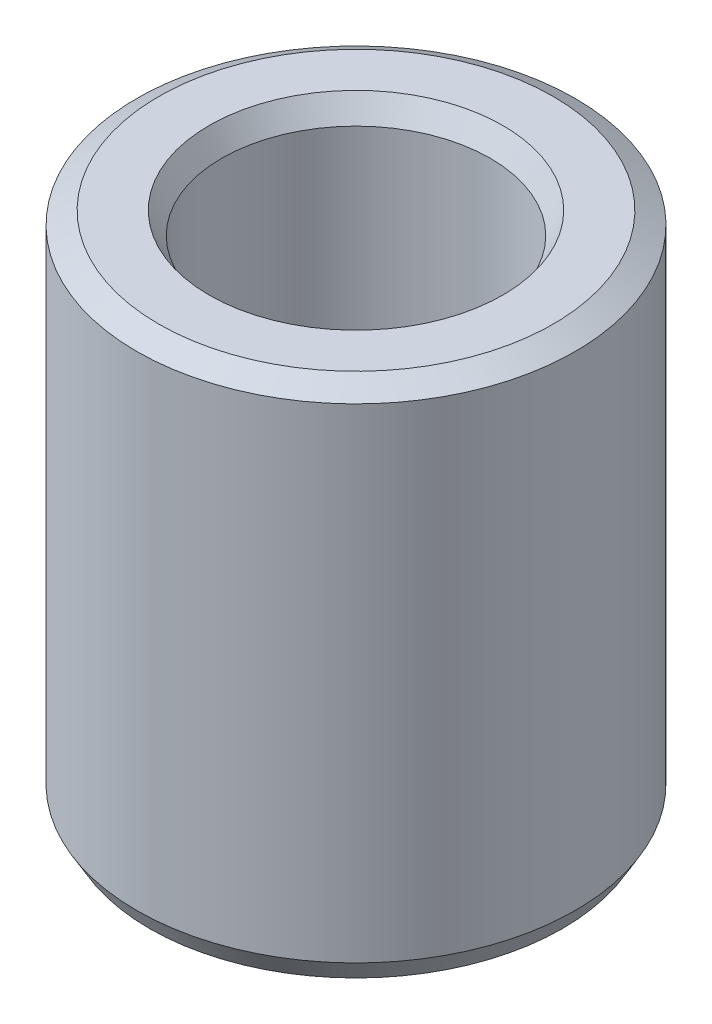
ISO-10303-21;
HEADER;
FILE_DESCRIPTION(('STEP AP214'),'2;1');
FILE_NAME('part.step','',(''),(''),'','','');
FILE_SCHEMA(('AUTOMOTIVE_DESIGN { 1 0 10303 214 1 1 1 1 }'));
ENDSEC;
DATA;
#1=APPLICATION_CONTEXT('core data for automotive mechanical design processes');
#2=APPLICATION_PROTOCOL_DEFINITION('international standard','automotive_design',2000,#1);
#3=PRODUCT_CONTEXT('',#1,'mechanical');
#4=PRODUCT('Part','Part','',(#3));
#5=PRODUCT_RELATED_PRODUCT_CATEGORY('part','',(#4));
#6=PRODUCT_DEFINITION_FORMATION('','',#4);
#7=PRODUCT_DEFINITION_CONTEXT('part definition',#1,'design');
#8=PRODUCT_DEFINITION('design','',#6,#7);
#9=PRODUCT_DEFINITION_SHAPE('','',#8);
#10=(LENGTH_UNIT() NAMED_UNIT(*) SI_UNIT(.MILLI.,.METRE.));
#11=(NAMED_UNIT(*) PLANE_ANGLE_UNIT() SI_UNIT($,.RADIAN.));
#12=(NAMED_UNIT(*) SI_UNIT($,.STERADIAN.) SOLID_ANGLE_UNIT());
#13=UNCERTAINTY_MEASURE_WITH_UNIT(LENGTH_MEASURE(1.E-05),#10,'distance_accuracy_value','');
#14=(GEOMETRIC_REPRESENTATION_CONTEXT(3) GLOBAL_UNCERTAINTY_ASSIGNED_CONTEXT((#13)) GLOBAL_UNIT_ASSIGNED_CONTEXT((#10,
#11,#12)) REPRESENTATION_CONTEXT('',''));
#15=CARTESIAN_POINT('',(0.,0.,0.));
#16=DIRECTION('',(0.,0.,1.));
#17=DIRECTION('',(1.,0.,0.));
#18=AXIS2_PLACEMENT_3D('',#15,#16,#17);
#19=CARTESIAN_POINT('',(0.,112.433210183823,0.));
#20=DIRECTION('',(0.,-1.,0.));
#21=DIRECTION('',(0.,0.,-1.));
#22=AXIS2_PLACEMENT_3D('',#19,#20,#21);
#23=CYLINDRICAL_SURFACE('',#22,47.5);
#24=CARTESIAN_POINT('',(0.,4.7651747466627,0.));
#25=DIRECTION('',(0.,1.,0.));
#26=DIRECTION('',(0.,0.,1.));
#27=AXIS2_PLACEMENT_3D('',#24,#25,#26);
#28=CIRCLE('',#27,47.5);
#29=CARTESIAN_POINT('',(0.,4.7651747466627,47.5));
#30=VERTEX_POINT('',#29);
#31=EDGE_CURVE('E10',#30,#30,#28,.T.);
#32=ORIENTED_EDGE('',*,*,#31,.T.);
#33=EDGE_LOOP('',(#32));
#34=FACE_BOUND('',#33,.T.);
#35=CARTESIAN_POINT('',(0.,109.682035261102,0.));
#36=DIRECTION('',(0.,1.,0.));
#37=DIRECTION('',(0.,0.,1.));
#38=AXIS2_PLACEMENT_3D('',#35,#36,#37);
#39=CIRCLE('',#38,47.5);
#40=CARTESIAN_POINT('',(0.,109.682035261102,-47.5));
#41=VERTEX_POINT('',#40);
#42=EDGE_CURVE('E50',#41,#41,#39,.F.);
#43=ORIENTED_EDGE('',*,*,#42,.T.);
#44=EDGE_LOOP('',(#43));
#45=FACE_BOUND('',#44,.T.);
#46=ADVANCED_FACE('F39',(#34,#45),#23,.T.);
#47=CARTESIAN_POINT('',(0.,112.433210183823,0.));
#48=DIRECTION('',(0.,1.,0.));
#49=DIRECTION('',(0.,0.,1.));
#50=AXIS2_PLACEMENT_3D('',#47,#48,#49);
#51=PLANE('',#50);
#52=CARTESIAN_POINT('',(0.,112.433210183823,0.));
#53=DIRECTION('',(0.,1.,0.));
#54=DIRECTION('',(0.,0.,1.));
#55=AXIS2_PLACEMENT_3D('',#52,#53,#54);
#56=CIRCLE('',#55,31.8315128872918);
#57=CARTESIAN_POINT('',(0.,112.433210183823,31.8315128872918));
#58=VERTEX_POINT('',#57);
#59=EDGE_CURVE('E58',#58,#58,#56,.F.);
#60=ORIENTED_EDGE('',*,*,#59,.T.);
#61=EDGE_LOOP('',(#60));
#62=FACE_BOUND('',#61,.T.);
#63=CARTESIAN_POINT('',(0.,112.433210183823,0.));
#64=DIRECTION('',(0.,1.,0.));
#65=DIRECTION('',(0.,0.,1.));
#66=AXIS2_PLACEMENT_3D('',#63,#64,#65);
#67=CIRCLE('',#66,42.7348252533374);
#68=CARTESIAN_POINT('',(0.,112.433210183823,-42.7348252533374));
#69=VERTEX_POINT('',#68);
#70=EDGE_CURVE('E61',#69,#69,#67,.T.);
#71=ORIENTED_EDGE('',*,*,#70,.T.);
#72=EDGE_LOOP('',(#71));
#73=FACE_BOUND('',#72,.T.);
#74=ADVANCED_FACE('F88',(#62,#73),#51,.T.);
#75=CARTESIAN_POINT('',(0.,0.,0.));
#76=DIRECTION('',(0.,1.,0.));
#77=DIRECTION('',(0.,0.,1.));
#78=AXIS2_PLACEMENT_3D('',#75,#76,#77);
#79=PLANE('',#78);
#80=CARTESIAN_POINT('',(0.,0.,0.));
#81=DIRECTION('',(0.,1.,0.));
#82=DIRECTION('',(0.,0.,1.));
#83=AXIS2_PLACEMENT_3D('',#80,#81,#82);
#84=CIRCLE('',#83,33.8455127112331);
#85=CARTESIAN_POINT('',(0.,0.,33.8455127112331));
#86=VERTEX_POINT('',#85);
#87=EDGE_CURVE('E51',#86,#86,#84,.T.);
#88=ORIENTED_EDGE('',*,*,#87,.T.);
#89=EDGE_LOOP('',(#88));
#90=FACE_BOUND('',#89,.T.);
#91=CARTESIAN_POINT('',(0.,0.,0.));
#92=DIRECTION('',(0.,1.,0.));
#93=DIRECTION('',(0.,0.,1.));
#94=AXIS2_PLACEMENT_3D('',#91,#92,#93);
#95=CIRCLE('',#94,44.7488250772787);
#96=CARTESIAN_POINT('',(0.,0.,44.7488250772787));
#97=VERTEX_POINT('',#96);
#98=EDGE_CURVE('E54',#97,#97,#95,.F.);
#99=ORIENTED_EDGE('',*,*,#98,.T.);
#100=EDGE_LOOP('',(#99));
#101=FACE_BOUND('',#100,.T.);
#102=ADVANCED_FACE('F83',(#90,#101),#79,.F.);
#103=CARTESIAN_POINT('',(0.,112.433210183823,0.));
#104=DIRECTION('',(0.,-1.,0.));
#105=DIRECTION('',(0.,0.,-1.));
#106=AXIS2_PLACEMENT_3D('',#103,#104,#105);
#107=CYLINDRICAL_SURFACE('',#106,29.0803379645705);
#108=CARTESIAN_POINT('',(0.,107.66803543716,0.));
#109=DIRECTION('',(0.,1.,0.));
#110=DIRECTION('',(0.,0.,1.));
#111=AXIS2_PLACEMENT_3D('',#108,#109,#110);
#112=CIRCLE('',#111,29.0803379645705);
#113=CARTESIAN_POINT('',(0.,107.66803543716,29.0803379645705));
#114=VERTEX_POINT('',#113);
#115=EDGE_CURVE('E67',#114,#114,#112,.T.);
#116=ORIENTED_EDGE('',*,*,#115,.T.);
#117=EDGE_LOOP('',(#116));
#118=FACE_BOUND('',#117,.T.);
#119=CARTESIAN_POINT('',(0.,2.75117492272131,0.));
#120=DIRECTION('',(0.,1.,0.));
#121=DIRECTION('',(0.,0.,1.));
#122=AXIS2_PLACEMENT_3D('',#119,#120,#121);
#123=CIRCLE('',#122,29.0803379645705);
#124=CARTESIAN_POINT('',(0.,2.75117492272131,29.0803379645705));
#125=VERTEX_POINT('',#124);
#126=EDGE_CURVE('E69',#125,#125,#123,.F.);
#127=ORIENTED_EDGE('',*,*,#126,.T.);
#128=EDGE_LOOP('',(#127));
#129=FACE_BOUND('',#128,.T.);
#130=ADVANCED_FACE('F71',(#118,#129),#107,.F.);
#131=CARTESIAN_POINT('',(0.,107.66803543716,0.));
#132=DIRECTION('',(0.,1.,0.));
#133=DIRECTION('',(0.,0.,1.));
#134=AXIS2_PLACEMENT_3D('',#131,#132,#133);
#135=CONICAL_SURFACE('',#134,29.0803379645705,0.523598775598303);
#136=ORIENTED_EDGE('',*,*,#59,.F.);
#137=EDGE_LOOP('',(#136));
#138=FACE_BOUND('',#137,.T.);
#139=ORIENTED_EDGE('',*,*,#115,.F.);
#140=EDGE_LOOP('',(#139));
#141=FACE_BOUND('',#140,.T.);
#142=ADVANCED_FACE('F77',(#138,#141),#135,.F.);
#143=CARTESIAN_POINT('',(0.,0.,0.));
#144=DIRECTION('',(0.,-1.,0.));
#145=DIRECTION('',(0.,0.,-1.));
#146=AXIS2_PLACEMENT_3D('',#143,#144,#145);
#147=CONICAL_SURFACE('',#146,33.8455127112331,1.04719755119659);
#148=ORIENTED_EDGE('',*,*,#126,.F.);
#149=EDGE_LOOP('',(#148));
#150=FACE_BOUND('',#149,.T.);
#151=ORIENTED_EDGE('',*,*,#87,.F.);
#152=EDGE_LOOP('',(#151));
#153=FACE_BOUND('',#152,.T.);
#154=ADVANCED_FACE('F73',(#150,#153),#147,.F.);
#155=CARTESIAN_POINT('',(0.,4.7651747466627,0.));
#156=DIRECTION('',(0.,1.,0.));
#157=DIRECTION('',(0.,0.,1.));
#158=AXIS2_PLACEMENT_3D('',#155,#156,#157);
#159=CONICAL_SURFACE('',#158,47.5,0.523598775598302);
#160=ORIENTED_EDGE('',*,*,#98,.F.);
#161=EDGE_LOOP('',(#160));
#162=FACE_BOUND('',#161,.T.);
#163=ORIENTED_EDGE('',*,*,#31,.F.);
#164=EDGE_LOOP('',(#163));
#165=FACE_BOUND('',#164,.T.);
#166=ADVANCED_FACE('F76',(#162,#165),#159,.T.);
#167=CARTESIAN_POINT('',(0.,112.433210183823,0.));
#168=DIRECTION('',(0.,-1.,0.));
#169=DIRECTION('',(0.,0.,-1.));
#170=AXIS2_PLACEMENT_3D('',#167,#168,#169);
#171=CONICAL_SURFACE('',#170,42.7348252533374,1.0471975511966);
#172=CARTESIAN_POINT('',(0.,109.682035261102,-47.5));
#173=CARTESIAN_POINT('',(0.,109.710693333213,-47.4503627630556));
#174=CARTESIAN_POINT('',(0.,109.739351405325,-47.4007255261112));
#175=CARTESIAN_POINT('',(0.,109.796667549548,-47.3014510522224));
#176=CARTESIAN_POINT('',(0.,109.82532562166,-47.251813815278));
#177=CARTESIAN_POINT('',(0.,109.882641765883,-47.1525393413892));
#178=CARTESIAN_POINT('',(0.,109.911299837995,-47.1029021044448));
#179=CARTESIAN_POINT('',(0.,109.968615982218,-47.003627630556));
#180=CARTESIAN_POINT('',(0.,109.99727405433,-46.9539903936116));
#181=CARTESIAN_POINT('',(0.,110.054590198553,-46.8547159197228));
#182=CARTESIAN_POINT('',(0.,110.083248270665,-46.8050786827784));
#183=CARTESIAN_POINT('',(0.,110.140564414888,-46.7058042088896));
#184=CARTESIAN_POINT('',(0.,110.169222487,-46.6561669719452));
#185=CARTESIAN_POINT('',(0.,110.226538631223,-46.5568924980564));
#186=CARTESIAN_POINT('',(0.,110.255196703335,-46.507255261112));
#187=CARTESIAN_POINT('',(0.,110.312512847559,-46.4079807872232));
#188=CARTESIAN_POINT('',(0.,110.34117091967,-46.3583435502788));
#189=CARTESIAN_POINT('',(0.,110.398487063894,-46.25906907639));
#190=CARTESIAN_POINT('',(0.,110.427145136005,-46.2094318394456));
#191=CARTESIAN_POINT('',(0.,110.484461280229,-46.1101573655568));
#192=CARTESIAN_POINT('',(0.,110.51311935234,-46.0605201286124));
#193=CARTESIAN_POINT('',(0.,110.570435496564,-45.9612456547235));
#194=CARTESIAN_POINT('',(0.,110.599093568675,-45.9116084177791));
#195=CARTESIAN_POINT('',(0.,110.656409712899,-45.8123339438903));
#196=CARTESIAN_POINT('',(0.,110.68506778501,-45.7626967069459));
#197=CARTESIAN_POINT('',(0.,110.742383929234,-45.6634222330571));
#198=CARTESIAN_POINT('',(0.,110.771042001345,-45.6137849961127));
#199=CARTESIAN_POINT('',(0.,110.828358145569,-45.5145105222239));
#200=CARTESIAN_POINT('',(0.,110.85701621768,-45.4648732852795));
#201=CARTESIAN_POINT('',(0.,110.914332361904,-45.3655988113907));
#202=CARTESIAN_POINT('',(0.,110.942990434015,-45.3159615744463));
#203=CARTESIAN_POINT('',(0.,111.000306578239,-45.2166871005575));
#204=CARTESIAN_POINT('',(0.,111.028964650351,-45.1670498636131));
#205=CARTESIAN_POINT('',(0.,111.086280794574,-45.0677753897243));
#206=CARTESIAN_POINT('',(0.,111.114938866686,-45.0181381527799));
#207=CARTESIAN_POINT('',(0.,111.172255010909,-44.9188636788911));
#208=CARTESIAN_POINT('',(0.,111.200913083021,-44.8692264419467));
#209=CARTESIAN_POINT('',(0.,111.258229227244,-44.7699519680579));
#210=CARTESIAN_POINT('',(0.,111.286887299356,-44.7203147311135));
#211=CARTESIAN_POINT('',(0.,111.344203443579,-44.6210402572247));
#212=CARTESIAN_POINT('',(0.,111.372861515691,-44.5714030202803));
#213=CARTESIAN_POINT('',(0.,111.430177659914,-44.4721285463915));
#214=CARTESIAN_POINT('',(0.,111.458835732026,-44.4224913094471));
#215=CARTESIAN_POINT('',(0.,111.516151876249,-44.3232168355583));
#216=CARTESIAN_POINT('',(0.,111.544809948361,-44.2735795986139));
#217=CARTESIAN_POINT('',(0.,111.602126092584,-44.1743051247251));
#218=CARTESIAN_POINT('',(0.,111.630784164696,-44.1246678877807));
#219=CARTESIAN_POINT('',(0.,111.688100308919,-44.0253934138919));
#220=CARTESIAN_POINT('',(0.,111.716758381031,-43.9757561769474));
#221=CARTESIAN_POINT('',(0.,111.774074525254,-43.8764817030587));
#222=CARTESIAN_POINT('',(0.,111.802732597366,-43.8268444661142));
#223=CARTESIAN_POINT('',(0.,111.860048741589,-43.7275699922254));
#224=CARTESIAN_POINT('',(0.,111.888706813701,-43.677932755281));
#225=CARTESIAN_POINT('',(0.,111.946022957924,-43.5786582813922));
#226=CARTESIAN_POINT('',(0.,111.974681030036,-43.5290210444478));
#227=CARTESIAN_POINT('',(0.,112.031997174259,-43.429746570559));
#228=CARTESIAN_POINT('',(0.,112.060655246371,-43.3801093336146));
#229=CARTESIAN_POINT('',(0.,112.117971390594,-43.2808348597258));
#230=CARTESIAN_POINT('',(0.,112.146629462706,-43.2311976227814));
#231=CARTESIAN_POINT('',(0.,112.203945606929,-43.1319231488926));
#232=CARTESIAN_POINT('',(0.,112.232603679041,-43.0822859119482));
#233=CARTESIAN_POINT('',(0.,112.289919823264,-42.9830114380594));
#234=CARTESIAN_POINT('',(0.,112.318577895376,-42.933374201115));
#235=CARTESIAN_POINT('',(0.,112.375894039599,-42.8340997272262));
#236=CARTESIAN_POINT('',(0.,112.404552111711,-42.7844624902818));
#237=CARTESIAN_POINT('',(0.,112.433210183823,-42.7348252533374));
#238=B_SPLINE_CURVE_WITH_KNOTS('',3,(#172,#173,#174,#175,#176,#177,#178,#179,#180,#181,#182,
#183,#184,#185,#186,#187,#188,#189,#190,#191,#192,#193,#194,#195,#196,#197,#198,#199,#200,#201,
#202,#203,#204,#205,#206,#207,#208,#209,#210,#211,#212,#213,#214,#215,#216,#217,#218,#219,#220,
#221,#222,#223,#224,#225,#226,#227,#228,#229,#230,#231,#232,#233,#234,#235,#236,#237),
.UNSPECIFIED.,.F.,.F.,(4,2,2,2,2,2,2,2,2,2,2,2,2,2,2,2,2,2,2,2,2,2,2,2,2,2,2,2,2,2,2,2,4),(0.,
0.171948432670084,0.343896865340161,0.515845298010238,0.687793730680322,0.859742163350399,
1.03169059602048,1.20363902869056,1.37558746136064,1.54753589403072,1.7194843267008,
1.89143275937088,2.06338119204096,2.23532962471103,2.40727805738111,2.5792264900512,
2.75117492272128,2.92312335539136,3.09507178806144,3.26702022073152,3.43896865340159,
3.61091708607167,3.78286551874176,3.95481395141183,4.12676238408192,4.298710816752,
4.47065924942208,4.64260768209215,4.81455611476223,4.98650454743231,5.15845298010239,
5.33040141277247,5.50234984544255),.UNSPECIFIED.);
#239=EDGE_CURVE('BSEAM45',#41,#69,#238,.T.);
#240=ORIENTED_EDGE('',*,*,#42,.F.);
#241=ORIENTED_EDGE('',*,*,#70,.F.);
#242=ORIENTED_EDGE('',*,*,#239,.T.);
#243=ORIENTED_EDGE('',*,*,#239,.F.);
#244=EDGE_LOOP('',(#240,#242,#241,#243));
#245=FACE_BOUND('',#244,.T.);
#246=ADVANCED_FACE('F45',(#245),#171,.T.);
#247=CLOSED_SHELL('',(#46,#74,#102,#130,#142,#154,#166,#246));
#248=MANIFOLD_SOLID_BREP('B2',#247);
#249=ADVANCED_BREP_SHAPE_REPRESENTATION('',(#18,#248),#14);
#250=SHAPE_DEFINITION_REPRESENTATION(#9,#249);
ENDSEC;
END-ISO-10303-21;
